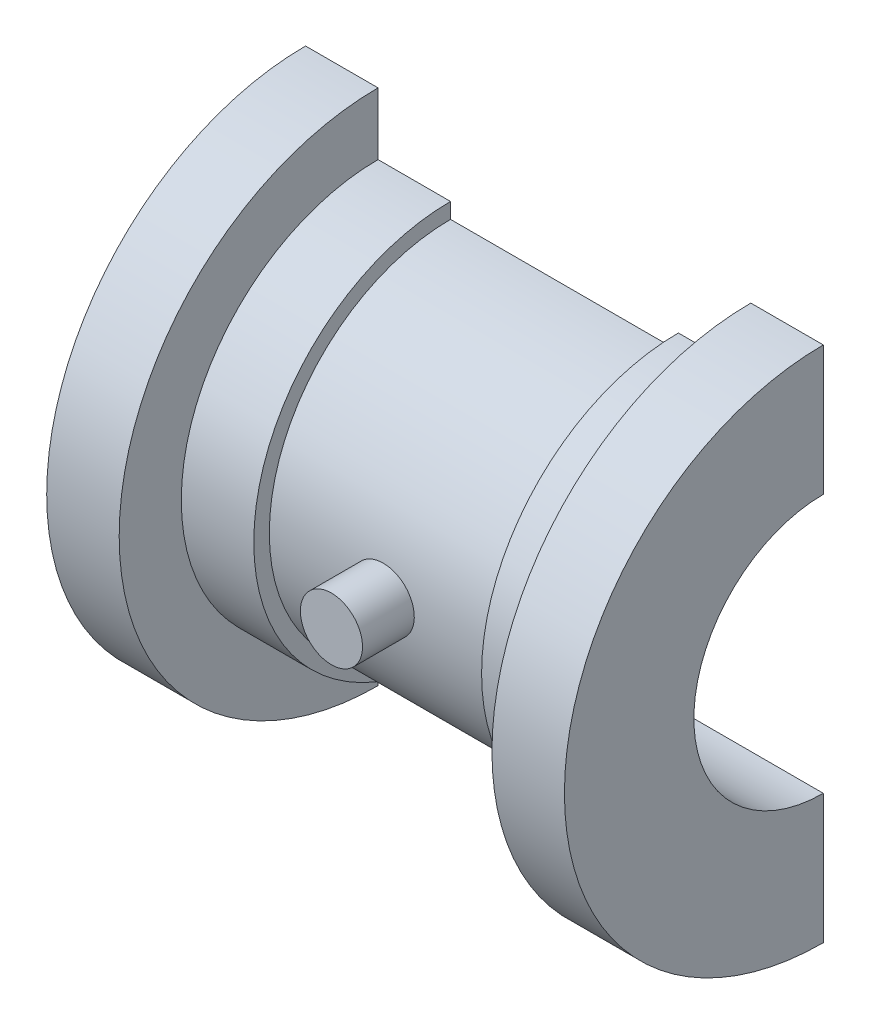
ISO-10303-21;
HEADER;
FILE_DESCRIPTION(('STEP AP214'),'2;1');
FILE_NAME('part.step','',(''),(''),'','','');
FILE_SCHEMA(('AUTOMOTIVE_DESIGN { 1 0 10303 214 1 1 1 1 }'));
ENDSEC;
DATA;
#1=APPLICATION_CONTEXT('core data for automotive mechanical design processes');
#2=APPLICATION_PROTOCOL_DEFINITION('international standard','automotive_design',2000,#1);
#3=PRODUCT_CONTEXT('',#1,'mechanical');
#4=PRODUCT('Part','Part','',(#3));
#5=PRODUCT_RELATED_PRODUCT_CATEGORY('part','',(#4));
#6=PRODUCT_DEFINITION_FORMATION('','',#4);
#7=PRODUCT_DEFINITION_CONTEXT('part definition',#1,'design');
#8=PRODUCT_DEFINITION('design','',#6,#7);
#9=PRODUCT_DEFINITION_SHAPE('','',#8);
#10=(LENGTH_UNIT() NAMED_UNIT(*) SI_UNIT(.MILLI.,.METRE.));
#11=(NAMED_UNIT(*) PLANE_ANGLE_UNIT() SI_UNIT($,.RADIAN.));
#12=(NAMED_UNIT(*) SI_UNIT($,.STERADIAN.) SOLID_ANGLE_UNIT());
#13=UNCERTAINTY_MEASURE_WITH_UNIT(LENGTH_MEASURE(1.E-05),#10,'distance_accuracy_value','');
#14=(GEOMETRIC_REPRESENTATION_CONTEXT(3) GLOBAL_UNCERTAINTY_ASSIGNED_CONTEXT((#13)) GLOBAL_UNIT_ASSIGNED_CONTEXT((#10,
#11,#12)) REPRESENTATION_CONTEXT('',''));
#15=CARTESIAN_POINT('',(0.,0.,0.));
#16=DIRECTION('',(0.,0.,1.));
#17=DIRECTION('',(1.,0.,0.));
#18=AXIS2_PLACEMENT_3D('',#15,#16,#17);
#19=CARTESIAN_POINT('',(0.,-1.57116660247941E-13,22.5));
#20=DIRECTION('',(0.,0.,-1.));
#21=DIRECTION('',(0.,1.,0.));
#22=AXIS2_PLACEMENT_3D('',#19,#20,#21);
#23=CYLINDRICAL_SURFACE('',#22,3.);
#24=CARTESIAN_POINT('',(0.,-1.57116660247941E-13,22.5));
#25=DIRECTION('',(0.,0.,-1.));
#26=DIRECTION('',(0.,1.,0.));
#27=AXIS2_PLACEMENT_3D('',#24,#25,#26);
#28=CIRCLE('',#27,3.);
#29=CARTESIAN_POINT('',(0.,2.99999999999984,22.5));
#30=VERTEX_POINT('',#29);
#31=EDGE_CURVE('E11',#30,#30,#28,.T.);
#32=ORIENTED_EDGE('',*,*,#31,.T.);
#33=EDGE_LOOP('',(#32));
#34=FACE_BOUND('',#33,.T.);
#35=CARTESIAN_POINT('',(0.,-1.2220184685951E-13,17.5));
#36=DIRECTION('',(0.,0.,-1.));
#37=DIRECTION('',(0.,1.,0.));
#38=AXIS2_PLACEMENT_3D('',#35,#36,#37);
#39=CIRCLE('',#38,3.);
#40=CARTESIAN_POINT('',(0.,2.99999999999988,17.5));
#41=VERTEX_POINT('',#40);
#42=EDGE_CURVE('E44',#41,#41,#39,.T.);
#43=ORIENTED_EDGE('',*,*,#42,.F.);
#44=EDGE_LOOP('',(#43));
#45=FACE_BOUND('',#44,.T.);
#46=ADVANCED_FACE('F41',(#34,#45),#23,.T.);
#47=CARTESIAN_POINT('',(0.,-1.57116660247941E-13,22.5));
#48=DIRECTION('',(0.,0.,-1.));
#49=DIRECTION('',(0.,1.,0.));
#50=AXIS2_PLACEMENT_3D('',#47,#48,#49);
#51=PLANE('',#50);
#52=ORIENTED_EDGE('',*,*,#31,.F.);
#53=EDGE_LOOP('',(#52));
#54=FACE_BOUND('',#53,.T.);
#55=ADVANCED_FACE('F56',(#54),#51,.F.);
#56=CARTESIAN_POINT('',(0.,-1.2220184685951E-13,17.5));
#57=DIRECTION('',(0.,0.,-1.));
#58=DIRECTION('',(0.,1.,0.));
#59=AXIS2_PLACEMENT_3D('',#56,#57,#58);
#60=PLANE('',#59);
#61=ORIENTED_EDGE('',*,*,#42,.T.);
#62=EDGE_LOOP('',(#61));
#63=FACE_BOUND('',#62,.T.);
#64=ADVANCED_FACE('F53',(#63),#60,.T.);
#65=CLOSED_SHELL('',(#46,#55,#64));
#66=MANIFOLD_SOLID_BREP('B2',#65);
#67=CARTESIAN_POINT('',(0.,0.,0.));
#68=DIRECTION('',(0.,0.,1.));
#69=DIRECTION('',(-1.,0.,0.));
#70=AXIS2_PLACEMENT_3D('',#67,#68,#69);
#71=PLANE('',#70);
#72=DIRECTION('',(0.,-1.,0.));
#73=VECTOR('',#72,1.);
#74=CARTESIAN_POINT('',(25.,0.,0.));
#75=LINE('',#74,#73);
#76=CARTESIAN_POINT('',(25.,25.,0.));
#77=VERTEX_POINT('',#76);
#78=CARTESIAN_POINT('',(25.,12.5,-1.74574066942157E-13));
#79=VERTEX_POINT('',#78);
#80=EDGE_CURVE('E182',#77,#79,#75,.T.);
#81=ORIENTED_EDGE('',*,*,#80,.T.);
#82=DIRECTION('',(-1.,0.,0.));
#83=VECTOR('',#82,1.);
#84=CARTESIAN_POINT('',(25.,12.5,-1.74574066942157E-13));
#85=LINE('',#84,#83);
#86=CARTESIAN_POINT('',(-25.,12.5,-1.74574066942157E-13));
#87=VERTEX_POINT('',#86);
#88=EDGE_CURVE('E169',#79,#87,#85,.T.);
#89=ORIENTED_EDGE('',*,*,#88,.T.);
#90=DIRECTION('',(0.,1.,0.));
#91=VECTOR('',#90,1.);
#92=CARTESIAN_POINT('',(-25.,0.,0.));
#93=LINE('',#92,#91);
#94=CARTESIAN_POINT('',(-25.,25.,0.));
#95=VERTEX_POINT('',#94);
#96=EDGE_CURVE('E248',#87,#95,#93,.T.);
#97=ORIENTED_EDGE('',*,*,#96,.T.);
#98=DIRECTION('',(-1.,0.,0.));
#99=VECTOR('',#98,1.);
#100=CARTESIAN_POINT('',(-25.,25.,0.));
#101=LINE('',#100,#99);
#102=CARTESIAN_POINT('',(-18.,25.,0.));
#103=VERTEX_POINT('',#102);
#104=EDGE_CURVE('E238',#103,#95,#101,.T.);
#105=ORIENTED_EDGE('',*,*,#104,.F.);
#106=DIRECTION('',(0.,1.,0.));
#107=VECTOR('',#106,1.);
#108=CARTESIAN_POINT('',(-18.,25.,0.));
#109=LINE('',#108,#107);
#110=CARTESIAN_POINT('',(-18.,19.,0.));
#111=VERTEX_POINT('',#110);
#112=EDGE_CURVE('E242',#111,#103,#109,.T.);
#113=ORIENTED_EDGE('',*,*,#112,.F.);
#114=DIRECTION('',(-1.,0.,0.));
#115=VECTOR('',#114,1.);
#116=CARTESIAN_POINT('',(-18.,19.,0.));
#117=LINE('',#116,#115);
#118=CARTESIAN_POINT('',(-11.,19.,0.));
#119=VERTEX_POINT('',#118);
#120=EDGE_CURVE('E246',#119,#111,#117,.T.);
#121=ORIENTED_EDGE('',*,*,#120,.F.);
#122=DIRECTION('',(0.,1.,0.));
#123=VECTOR('',#122,1.);
#124=CARTESIAN_POINT('',(-11.,19.,0.));
#125=LINE('',#124,#123);
#126=CARTESIAN_POINT('',(-11.,17.5,0.));
#127=VERTEX_POINT('',#126);
#128=EDGE_CURVE('E251',#127,#119,#125,.T.);
#129=ORIENTED_EDGE('',*,*,#128,.F.);
#130=DIRECTION('',(-1.,0.,0.));
#131=VECTOR('',#130,1.);
#132=CARTESIAN_POINT('',(-11.,17.5,0.));
#133=LINE('',#132,#131);
#134=CARTESIAN_POINT('',(11.,17.5,0.));
#135=VERTEX_POINT('',#134);
#136=EDGE_CURVE('E254',#135,#127,#133,.T.);
#137=ORIENTED_EDGE('',*,*,#136,.F.);
#138=DIRECTION('',(0.,-1.,0.));
#139=VECTOR('',#138,1.);
#140=CARTESIAN_POINT('',(11.,19.,0.));
#141=LINE('',#140,#139);
#142=CARTESIAN_POINT('',(11.,19.,0.));
#143=VERTEX_POINT('',#142);
#144=EDGE_CURVE('E257',#143,#135,#141,.T.);
#145=ORIENTED_EDGE('',*,*,#144,.F.);
#146=DIRECTION('',(-1.,0.,0.));
#147=VECTOR('',#146,1.);
#148=CARTESIAN_POINT('',(18.,19.,0.));
#149=LINE('',#148,#147);
#150=CARTESIAN_POINT('',(18.,19.,0.));
#151=VERTEX_POINT('',#150);
#152=EDGE_CURVE('E260',#151,#143,#149,.T.);
#153=ORIENTED_EDGE('',*,*,#152,.F.);
#154=DIRECTION('',(0.,-1.,0.));
#155=VECTOR('',#154,1.);
#156=CARTESIAN_POINT('',(18.,25.,0.));
#157=LINE('',#156,#155);
#158=CARTESIAN_POINT('',(18.,25.,0.));
#159=VERTEX_POINT('',#158);
#160=EDGE_CURVE('E263',#159,#151,#157,.T.);
#161=ORIENTED_EDGE('',*,*,#160,.F.);
#162=DIRECTION('',(-1.,0.,0.));
#163=VECTOR('',#162,1.);
#164=CARTESIAN_POINT('',(25.,25.,0.));
#165=LINE('',#164,#163);
#166=EDGE_CURVE('E189',#77,#159,#165,.T.);
#167=ORIENTED_EDGE('',*,*,#166,.F.);
#168=EDGE_LOOP('',(#81,#89,#97,#105,#113,#121,#129,#137,#145,#153,#161,#167));
#169=FACE_BOUND('',#168,.T.);
#170=ADVANCED_FACE('F82',(#169),#71,.F.);
#171=CARTESIAN_POINT('',(-25.,0.,0.));
#172=DIRECTION('',(1.,0.,0.));
#173=DIRECTION('',(0.,1.,0.));
#174=AXIS2_PLACEMENT_3D('',#171,#172,#173);
#175=PLANE('',#174);
#176=ORIENTED_EDGE('',*,*,#96,.F.);
#177=CARTESIAN_POINT('',(-25.,0.,0.));
#178=DIRECTION('',(-1.,0.,0.));
#179=DIRECTION('',(0.,-1.,0.));
#180=AXIS2_PLACEMENT_3D('',#177,#178,#179);
#181=CIRCLE('',#180,12.5);
#182=CARTESIAN_POINT('',(-25.,-12.5,-1.74574066942157E-13));
#183=VERTEX_POINT('',#182);
#184=EDGE_CURVE('E172',#183,#87,#181,.T.);
#185=ORIENTED_EDGE('',*,*,#184,.F.);
#186=CARTESIAN_POINT('',(-25.,-25.,-1.74574066942157E-13));
#187=VERTEX_POINT('',#186);
#188=EDGE_CURVE('E195',#187,#183,#93,.T.);
#189=ORIENTED_EDGE('',*,*,#188,.F.);
#190=CARTESIAN_POINT('',(-25.,0.,0.));
#191=DIRECTION('',(-1.,0.,0.));
#192=DIRECTION('',(0.,-1.,0.));
#193=AXIS2_PLACEMENT_3D('',#190,#191,#192);
#194=CIRCLE('',#193,25.);
#195=EDGE_CURVE('E39',#187,#95,#194,.T.);
#196=ORIENTED_EDGE('',*,*,#195,.T.);
#197=EDGE_LOOP('',(#176,#185,#189,#196));
#198=FACE_BOUND('',#197,.T.);
#199=ADVANCED_FACE('F272',(#198),#175,.F.);
#200=CARTESIAN_POINT('',(-38.9493607052265,0.,0.));
#201=DIRECTION('',(-1.,0.,0.));
#202=DIRECTION('',(0.,-1.,0.));
#203=AXIS2_PLACEMENT_3D('',#200,#201,#202);
#204=CYLINDRICAL_SURFACE('',#203,25.);
#205=CARTESIAN_POINT('',(-18.,0.,0.));
#206=DIRECTION('',(-1.,0.,0.));
#207=DIRECTION('',(0.,-1.,0.));
#208=AXIS2_PLACEMENT_3D('',#205,#206,#207);
#209=CIRCLE('',#208,25.);
#210=CARTESIAN_POINT('',(-18.,-25.,-1.74574066942157E-13));
#211=VERTEX_POINT('',#210);
#212=EDGE_CURVE('E90',#211,#103,#209,.T.);
#213=ORIENTED_EDGE('',*,*,#212,.T.);
#214=ORIENTED_EDGE('',*,*,#104,.T.);
#215=ORIENTED_EDGE('',*,*,#195,.F.);
#216=DIRECTION('',(-1.,0.,0.));
#217=VECTOR('',#216,1.);
#218=CARTESIAN_POINT('',(-25.,-25.,-1.74574066942157E-13));
#219=LINE('',#218,#217);
#220=EDGE_CURVE('E219',#211,#187,#219,.T.);
#221=ORIENTED_EDGE('',*,*,#220,.F.);
#222=EDGE_LOOP('',(#213,#214,#215,#221));
#223=FACE_BOUND('',#222,.T.);
#224=ADVANCED_FACE('F84',(#223),#204,.T.);
#225=CARTESIAN_POINT('',(-18.,-25.,-1.74574066942157E-13));
#226=DIRECTION('',(-1.,0.,0.));
#227=DIRECTION('',(0.,-1.,0.));
#228=AXIS2_PLACEMENT_3D('',#225,#226,#227);
#229=PLANE('',#228);
#230=CARTESIAN_POINT('',(-18.,0.,0.));
#231=DIRECTION('',(-1.,0.,0.));
#232=DIRECTION('',(0.,-1.,0.));
#233=AXIS2_PLACEMENT_3D('',#230,#231,#232);
#234=CIRCLE('',#233,19.);
#235=CARTESIAN_POINT('',(-18.,-19.,-1.32676290876039E-13));
#236=VERTEX_POINT('',#235);
#237=EDGE_CURVE('E235',#236,#111,#234,.T.);
#238=ORIENTED_EDGE('',*,*,#237,.T.);
#239=ORIENTED_EDGE('',*,*,#112,.T.);
#240=ORIENTED_EDGE('',*,*,#212,.F.);
#241=DIRECTION('',(0.,-1.,0.));
#242=VECTOR('',#241,1.);
#243=CARTESIAN_POINT('',(-18.,-25.,-1.74574066942157E-13));
#244=LINE('',#243,#242);
#245=EDGE_CURVE('E216',#236,#211,#244,.T.);
#246=ORIENTED_EDGE('',*,*,#245,.F.);
#247=EDGE_LOOP('',(#238,#239,#240,#246));
#248=FACE_BOUND('',#247,.T.);
#249=ADVANCED_FACE('F243',(#248),#229,.F.);
#250=CARTESIAN_POINT('',(-38.9493607052265,0.,0.));
#251=DIRECTION('',(-1.,0.,0.));
#252=DIRECTION('',(0.,-1.,0.));
#253=AXIS2_PLACEMENT_3D('',#250,#251,#252);
#254=CYLINDRICAL_SURFACE('',#253,19.);
#255=CARTESIAN_POINT('',(-11.,0.,0.));
#256=DIRECTION('',(-1.,0.,0.));
#257=DIRECTION('',(0.,-1.,0.));
#258=AXIS2_PLACEMENT_3D('',#255,#256,#257);
#259=CIRCLE('',#258,19.);
#260=CARTESIAN_POINT('',(-11.,-19.,-1.32676290876039E-13));
#261=VERTEX_POINT('',#260);
#262=EDGE_CURVE('E233',#261,#119,#259,.T.);
#263=ORIENTED_EDGE('',*,*,#262,.T.);
#264=ORIENTED_EDGE('',*,*,#120,.T.);
#265=ORIENTED_EDGE('',*,*,#237,.F.);
#266=DIRECTION('',(-1.,0.,0.));
#267=VECTOR('',#266,1.);
#268=CARTESIAN_POINT('',(-18.,-19.,-1.32676290876039E-13));
#269=LINE('',#268,#267);
#270=EDGE_CURVE('E213',#261,#236,#269,.T.);
#271=ORIENTED_EDGE('',*,*,#270,.F.);
#272=EDGE_LOOP('',(#263,#264,#265,#271));
#273=FACE_BOUND('',#272,.T.);
#274=ADVANCED_FACE('F277',(#273),#254,.T.);
#275=CARTESIAN_POINT('',(-11.,-19.,-1.32676290876039E-13));
#276=DIRECTION('',(-1.,0.,0.));
#277=DIRECTION('',(0.,-1.,0.));
#278=AXIS2_PLACEMENT_3D('',#275,#276,#277);
#279=PLANE('',#278);
#280=CARTESIAN_POINT('',(-11.,0.,0.));
#281=DIRECTION('',(-1.,0.,0.));
#282=DIRECTION('',(0.,-1.,0.));
#283=AXIS2_PLACEMENT_3D('',#280,#281,#282);
#284=CIRCLE('',#283,17.5);
#285=CARTESIAN_POINT('',(-11.,-17.5,-1.2220184685951E-13));
#286=VERTEX_POINT('',#285);
#287=EDGE_CURVE('E231',#286,#127,#284,.T.);
#288=ORIENTED_EDGE('',*,*,#287,.T.);
#289=ORIENTED_EDGE('',*,*,#128,.T.);
#290=ORIENTED_EDGE('',*,*,#262,.F.);
#291=DIRECTION('',(0.,-1.,0.));
#292=VECTOR('',#291,1.);
#293=CARTESIAN_POINT('',(-11.,-19.,-1.32676290876039E-13));
#294=LINE('',#293,#292);
#295=EDGE_CURVE('E210',#286,#261,#294,.T.);
#296=ORIENTED_EDGE('',*,*,#295,.F.);
#297=EDGE_LOOP('',(#288,#289,#290,#296));
#298=FACE_BOUND('',#297,.T.);
#299=ADVANCED_FACE('F282',(#298),#279,.F.);
#300=CARTESIAN_POINT('',(-38.9493607052265,0.,0.));
#301=DIRECTION('',(-1.,0.,0.));
#302=DIRECTION('',(0.,-1.,0.));
#303=AXIS2_PLACEMENT_3D('',#300,#301,#302);
#304=CYLINDRICAL_SURFACE('',#303,17.5);
#305=CARTESIAN_POINT('',(11.,0.,0.));
#306=DIRECTION('',(-1.,0.,0.));
#307=DIRECTION('',(0.,-1.,0.));
#308=AXIS2_PLACEMENT_3D('',#305,#306,#307);
#309=CIRCLE('',#308,17.5);
#310=CARTESIAN_POINT('',(11.,-17.5,-1.2220184685951E-13));
#311=VERTEX_POINT('',#310);
#312=EDGE_CURVE('E229',#311,#135,#309,.T.);
#313=ORIENTED_EDGE('',*,*,#312,.T.);
#314=ORIENTED_EDGE('',*,*,#136,.T.);
#315=ORIENTED_EDGE('',*,*,#287,.F.);
#316=DIRECTION('',(-1.,0.,0.));
#317=VECTOR('',#316,1.);
#318=CARTESIAN_POINT('',(-11.,-17.5,-1.2220184685951E-13));
#319=LINE('',#318,#317);
#320=EDGE_CURVE('E207',#311,#286,#319,.T.);
#321=ORIENTED_EDGE('',*,*,#320,.F.);
#322=EDGE_LOOP('',(#313,#314,#315,#321));
#323=FACE_BOUND('',#322,.T.);
#324=ADVANCED_FACE('F285',(#323),#304,.T.);
#325=CARTESIAN_POINT('',(11.,-19.,-1.32676290876039E-13));
#326=DIRECTION('',(1.,0.,0.));
#327=DIRECTION('',(0.,1.,0.));
#328=AXIS2_PLACEMENT_3D('',#325,#326,#327);
#329=PLANE('',#328);
#330=CARTESIAN_POINT('',(11.,0.,0.));
#331=DIRECTION('',(-1.,0.,0.));
#332=DIRECTION('',(0.,-1.,0.));
#333=AXIS2_PLACEMENT_3D('',#330,#331,#332);
#334=CIRCLE('',#333,19.);
#335=CARTESIAN_POINT('',(11.,-19.,-1.32676290876039E-13));
#336=VERTEX_POINT('',#335);
#337=EDGE_CURVE('E227',#336,#143,#334,.T.);
#338=ORIENTED_EDGE('',*,*,#337,.T.);
#339=ORIENTED_EDGE('',*,*,#144,.T.);
#340=ORIENTED_EDGE('',*,*,#312,.F.);
#341=DIRECTION('',(0.,1.,0.));
#342=VECTOR('',#341,1.);
#343=CARTESIAN_POINT('',(11.,-19.,-1.32676290876039E-13));
#344=LINE('',#343,#342);
#345=EDGE_CURVE('E204',#336,#311,#344,.T.);
#346=ORIENTED_EDGE('',*,*,#345,.F.);
#347=EDGE_LOOP('',(#338,#339,#340,#346));
#348=FACE_BOUND('',#347,.T.);
#349=ADVANCED_FACE('F288',(#348),#329,.F.);
#350=CARTESIAN_POINT('',(-38.9493607052265,0.,0.));
#351=DIRECTION('',(-1.,0.,0.));
#352=DIRECTION('',(0.,-1.,0.));
#353=AXIS2_PLACEMENT_3D('',#350,#351,#352);
#354=CYLINDRICAL_SURFACE('',#353,19.);
#355=CARTESIAN_POINT('',(18.,0.,0.));
#356=DIRECTION('',(-1.,0.,0.));
#357=DIRECTION('',(0.,-1.,0.));
#358=AXIS2_PLACEMENT_3D('',#355,#356,#357);
#359=CIRCLE('',#358,19.);
#360=CARTESIAN_POINT('',(18.,-19.,-1.32676290876039E-13));
#361=VERTEX_POINT('',#360);
#362=EDGE_CURVE('E225',#361,#151,#359,.T.);
#363=ORIENTED_EDGE('',*,*,#362,.T.);
#364=ORIENTED_EDGE('',*,*,#152,.T.);
#365=ORIENTED_EDGE('',*,*,#337,.F.);
#366=DIRECTION('',(-1.,0.,0.));
#367=VECTOR('',#366,1.);
#368=CARTESIAN_POINT('',(18.,-19.,-1.32676290876039E-13));
#369=LINE('',#368,#367);
#370=EDGE_CURVE('E201',#361,#336,#369,.T.);
#371=ORIENTED_EDGE('',*,*,#370,.F.);
#372=EDGE_LOOP('',(#363,#364,#365,#371));
#373=FACE_BOUND('',#372,.T.);
#374=ADVANCED_FACE('F291',(#373),#354,.T.);
#375=CARTESIAN_POINT('',(18.,-25.,-1.74574066942157E-13));
#376=DIRECTION('',(1.,0.,0.));
#377=DIRECTION('',(0.,1.,0.));
#378=AXIS2_PLACEMENT_3D('',#375,#376,#377);
#379=PLANE('',#378);
#380=CARTESIAN_POINT('',(18.,0.,0.));
#381=DIRECTION('',(-1.,0.,0.));
#382=DIRECTION('',(0.,-1.,0.));
#383=AXIS2_PLACEMENT_3D('',#380,#381,#382);
#384=CIRCLE('',#383,25.);
#385=CARTESIAN_POINT('',(18.,-25.,-1.74574066942157E-13));
#386=VERTEX_POINT('',#385);
#387=EDGE_CURVE('E223',#386,#159,#384,.T.);
#388=ORIENTED_EDGE('',*,*,#387,.T.);
#389=ORIENTED_EDGE('',*,*,#160,.T.);
#390=ORIENTED_EDGE('',*,*,#362,.F.);
#391=DIRECTION('',(0.,1.,0.));
#392=VECTOR('',#391,1.);
#393=CARTESIAN_POINT('',(18.,-25.,-1.74574066942157E-13));
#394=LINE('',#393,#392);
#395=EDGE_CURVE('E193',#386,#361,#394,.T.);
#396=ORIENTED_EDGE('',*,*,#395,.F.);
#397=EDGE_LOOP('',(#388,#389,#390,#396));
#398=FACE_BOUND('',#397,.T.);
#399=ADVANCED_FACE('F295',(#398),#379,.F.);
#400=CARTESIAN_POINT('',(-38.9493607052265,0.,0.));
#401=DIRECTION('',(-1.,0.,0.));
#402=DIRECTION('',(0.,-1.,0.));
#403=AXIS2_PLACEMENT_3D('',#400,#401,#402);
#404=CYLINDRICAL_SURFACE('',#403,25.);
#405=CARTESIAN_POINT('',(25.,0.,0.));
#406=DIRECTION('',(-1.,0.,0.));
#407=DIRECTION('',(0.,-1.,0.));
#408=AXIS2_PLACEMENT_3D('',#405,#406,#407);
#409=CIRCLE('',#408,25.);
#410=CARTESIAN_POINT('',(25.,-25.,-1.74574066942157E-13));
#411=VERTEX_POINT('',#410);
#412=EDGE_CURVE('E221',#411,#77,#409,.T.);
#413=ORIENTED_EDGE('',*,*,#412,.T.);
#414=ORIENTED_EDGE('',*,*,#166,.T.);
#415=ORIENTED_EDGE('',*,*,#387,.F.);
#416=DIRECTION('',(-1.,0.,0.));
#417=VECTOR('',#416,1.);
#418=CARTESIAN_POINT('',(25.,-25.,-1.74574066942157E-13));
#419=LINE('',#418,#417);
#420=EDGE_CURVE('E190',#411,#386,#419,.T.);
#421=ORIENTED_EDGE('',*,*,#420,.F.);
#422=EDGE_LOOP('',(#413,#414,#415,#421));
#423=FACE_BOUND('',#422,.T.);
#424=ADVANCED_FACE('F298',(#423),#404,.T.);
#425=CARTESIAN_POINT('',(25.,0.,0.));
#426=DIRECTION('',(-1.,0.,0.));
#427=DIRECTION('',(0.,-1.,0.));
#428=AXIS2_PLACEMENT_3D('',#425,#426,#427);
#429=PLANE('',#428);
#430=CARTESIAN_POINT('',(25.,-12.5,0.));
#431=VERTEX_POINT('',#430);
#432=EDGE_CURVE('E184',#431,#411,#75,.T.);
#433=ORIENTED_EDGE('',*,*,#432,.F.);
#434=CARTESIAN_POINT('',(25.,0.,0.));
#435=DIRECTION('',(-1.,0.,0.));
#436=DIRECTION('',(0.,-1.,0.));
#437=AXIS2_PLACEMENT_3D('',#434,#435,#436);
#438=CIRCLE('',#437,12.5);
#439=EDGE_CURVE('E97',#431,#79,#438,.T.);
#440=ORIENTED_EDGE('',*,*,#439,.T.);
#441=ORIENTED_EDGE('',*,*,#80,.F.);
#442=ORIENTED_EDGE('',*,*,#412,.F.);
#443=EDGE_LOOP('',(#433,#440,#441,#442));
#444=FACE_BOUND('',#443,.T.);
#445=ADVANCED_FACE('F180',(#444),#429,.F.);
#446=ORIENTED_EDGE('',*,*,#188,.T.);
#447=DIRECTION('',(-1.,0.,0.));
#448=VECTOR('',#447,1.);
#449=CARTESIAN_POINT('',(25.,-12.5,-1.74574066942157E-13));
#450=LINE('',#449,#448);
#451=EDGE_CURVE('E176',#431,#183,#450,.T.);
#452=ORIENTED_EDGE('',*,*,#451,.F.);
#453=ORIENTED_EDGE('',*,*,#432,.T.);
#454=ORIENTED_EDGE('',*,*,#420,.T.);
#455=ORIENTED_EDGE('',*,*,#395,.T.);
#456=ORIENTED_EDGE('',*,*,#370,.T.);
#457=ORIENTED_EDGE('',*,*,#345,.T.);
#458=ORIENTED_EDGE('',*,*,#320,.T.);
#459=ORIENTED_EDGE('',*,*,#295,.T.);
#460=ORIENTED_EDGE('',*,*,#270,.T.);
#461=ORIENTED_EDGE('',*,*,#245,.T.);
#462=ORIENTED_EDGE('',*,*,#220,.T.);
#463=EDGE_LOOP('',(#446,#452,#453,#454,#455,#456,#457,#458,#459,#460,#461,#462));
#464=FACE_BOUND('',#463,.T.);
#465=ADVANCED_FACE('F273',(#464),#71,.F.);
#466=CARTESIAN_POINT('',(25.,0.,0.));
#467=DIRECTION('',(-1.,0.,0.));
#468=DIRECTION('',(0.,-1.,0.));
#469=AXIS2_PLACEMENT_3D('',#466,#467,#468);
#470=CYLINDRICAL_SURFACE('',#469,12.5);
#471=ORIENTED_EDGE('',*,*,#184,.T.);
#472=ORIENTED_EDGE('',*,*,#88,.F.);
#473=ORIENTED_EDGE('',*,*,#439,.F.);
#474=ORIENTED_EDGE('',*,*,#451,.T.);
#475=EDGE_LOOP('',(#471,#472,#473,#474));
#476=FACE_BOUND('',#475,.T.);
#477=ADVANCED_FACE('F170',(#476),#470,.F.);
#478=CLOSED_SHELL('',(#170,#199,#224,#249,#274,#299,#324,#349,#374,#399,#424,#445,#465,#477));
#479=MANIFOLD_SOLID_BREP('B6',#478);
#480=ADVANCED_BREP_SHAPE_REPRESENTATION('',(#18,#66,#479),#14);
#481=SHAPE_DEFINITION_REPRESENTATION(#9,#480);
ENDSEC;
END-ISO-10303-21;
